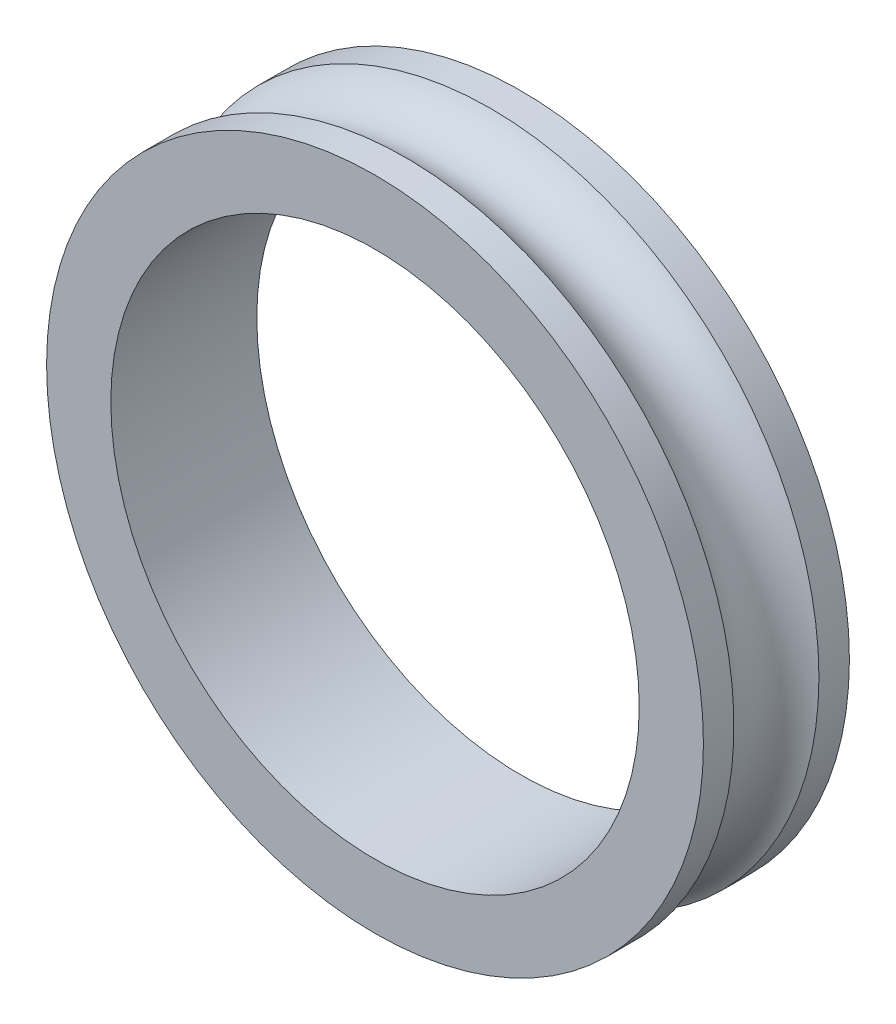
ISO-10303-21;
HEADER;
FILE_DESCRIPTION(('STEP AP214'),'2;1');
FILE_NAME('part.step','',(''),(''),'','','');
FILE_SCHEMA(('AUTOMOTIVE_DESIGN { 1 0 10303 214 1 1 1 1 }'));
ENDSEC;
DATA;
#1=APPLICATION_CONTEXT('core data for automotive mechanical design processes');
#2=APPLICATION_PROTOCOL_DEFINITION('international standard','automotive_design',2000,#1);
#3=PRODUCT_CONTEXT('',#1,'mechanical');
#4=PRODUCT('Part','Part','',(#3));
#5=PRODUCT_RELATED_PRODUCT_CATEGORY('part','',(#4));
#6=PRODUCT_DEFINITION_FORMATION('','',#4);
#7=PRODUCT_DEFINITION_CONTEXT('part definition',#1,'design');
#8=PRODUCT_DEFINITION('design','',#6,#7);
#9=PRODUCT_DEFINITION_SHAPE('','',#8);
#10=(LENGTH_UNIT() NAMED_UNIT(*) SI_UNIT(.MILLI.,.METRE.));
#11=(NAMED_UNIT(*) PLANE_ANGLE_UNIT() SI_UNIT($,.RADIAN.));
#12=(NAMED_UNIT(*) SI_UNIT($,.STERADIAN.) SOLID_ANGLE_UNIT());
#13=UNCERTAINTY_MEASURE_WITH_UNIT(LENGTH_MEASURE(1.E-05),#10,'distance_accuracy_value','');
#14=(GEOMETRIC_REPRESENTATION_CONTEXT(3) GLOBAL_UNCERTAINTY_ASSIGNED_CONTEXT((#13)) GLOBAL_UNIT_ASSIGNED_CONTEXT((#10,
#11,#12)) REPRESENTATION_CONTEXT('',''));
#15=CARTESIAN_POINT('',(0.,0.,0.));
#16=DIRECTION('',(0.,0.,1.));
#17=DIRECTION('',(1.,0.,0.));
#18=AXIS2_PLACEMENT_3D('',#15,#16,#17);
#19=CARTESIAN_POINT('',(0.,0.,73.6396103067893));
#20=DIRECTION('',(0.,0.,-1.));
#21=DIRECTION('',(-1.,0.,0.));
#22=AXIS2_PLACEMENT_3D('',#19,#20,#21);
#23=CYLINDRICAL_SURFACE('',#22,22.5);
#24=CARTESIAN_POINT('',(0.,0.,2.08870733178541));
#25=DIRECTION('',(0.,0.,1.));
#26=DIRECTION('',(1.,0.,0.));
#27=AXIS2_PLACEMENT_3D('',#24,#25,#26);
#28=CIRCLE('',#27,22.5);
#29=CARTESIAN_POINT('',(22.5,0.,2.08870733178541));
#30=VERTEX_POINT('',#29);
#31=EDGE_CURVE('E36',#30,#30,#28,.F.);
#32=ORIENTED_EDGE('',*,*,#31,.T.);
#33=EDGE_LOOP('',(#32));
#34=FACE_BOUND('',#33,.T.);
#35=CARTESIAN_POINT('',(0.,0.,0.));
#36=DIRECTION('',(0.,0.,1.));
#37=DIRECTION('',(1.,0.,0.));
#38=AXIS2_PLACEMENT_3D('',#35,#36,#37);
#39=CIRCLE('',#38,22.5);
#40=CARTESIAN_POINT('',(22.5,0.,0.));
#41=VERTEX_POINT('',#40);
#42=EDGE_CURVE('E40',#41,#41,#39,.T.);
#43=ORIENTED_EDGE('',*,*,#42,.T.);
#44=EDGE_LOOP('',(#43));
#45=FACE_BOUND('',#44,.T.);
#46=ADVANCED_FACE('F32',(#34,#45),#23,.T.);
#47=CARTESIAN_POINT('',(0.,0.,7.9112926682146));
#48=DIRECTION('',(0.,0.,-1.));
#49=DIRECTION('',(-1.,0.,0.));
#50=AXIS2_PLACEMENT_3D('',#47,#48,#49);
#51=CIRCLE('',#50,22.5);
#52=CARTESIAN_POINT('',(-22.5,0.,7.9112926682146));
#53=VERTEX_POINT('',#52);
#54=EDGE_CURVE('E48',#53,#53,#51,.F.);
#55=ORIENTED_EDGE('',*,*,#54,.T.);
#56=EDGE_LOOP('',(#55));
#57=FACE_BOUND('',#56,.T.);
#58=CARTESIAN_POINT('',(0.,0.,9.99999999999999));
#59=DIRECTION('',(0.,0.,1.));
#60=DIRECTION('',(1.,0.,0.));
#61=AXIS2_PLACEMENT_3D('',#58,#59,#60);
#62=CIRCLE('',#61,22.5);
#63=CARTESIAN_POINT('',(22.5,0.,9.99999999999999));
#64=VERTEX_POINT('',#63);
#65=EDGE_CURVE('E10',#64,#64,#62,.T.);
#66=ORIENTED_EDGE('',*,*,#65,.F.);
#67=EDGE_LOOP('',(#66));
#68=FACE_BOUND('',#67,.T.);
#69=ADVANCED_FACE('F68',(#57,#68),#23,.T.);
#70=CARTESIAN_POINT('',(0.,0.,0.));
#71=DIRECTION('',(0.,0.,1.));
#72=DIRECTION('',(1.,0.,0.));
#73=AXIS2_PLACEMENT_3D('',#70,#71,#72);
#74=PLANE('',#73);
#75=CARTESIAN_POINT('',(0.,0.,0.));
#76=DIRECTION('',(0.,0.,1.));
#77=DIRECTION('',(1.,0.,0.));
#78=AXIS2_PLACEMENT_3D('',#75,#76,#77);
#79=CIRCLE('',#78,18.1);
#80=CARTESIAN_POINT('',(18.1,0.,0.));
#81=VERTEX_POINT('',#80);
#82=EDGE_CURVE('E45',#81,#81,#79,.F.);
#83=ORIENTED_EDGE('',*,*,#82,.F.);
#84=EDGE_LOOP('',(#83));
#85=FACE_BOUND('',#84,.T.);
#86=ORIENTED_EDGE('',*,*,#42,.F.);
#87=EDGE_LOOP('',(#86));
#88=FACE_BOUND('',#87,.T.);
#89=ADVANCED_FACE('F65',(#85,#88),#74,.F.);
#90=CARTESIAN_POINT('',(0.,0.,10.));
#91=DIRECTION('',(0.,0.,1.));
#92=DIRECTION('',(1.,0.,0.));
#93=AXIS2_PLACEMENT_3D('',#90,#91,#92);
#94=PLANE('',#93);
#95=CARTESIAN_POINT('',(0.,0.,10.));
#96=DIRECTION('',(0.,0.,1.));
#97=DIRECTION('',(1.,0.,0.));
#98=AXIS2_PLACEMENT_3D('',#95,#96,#97);
#99=CIRCLE('',#98,18.1);
#100=CARTESIAN_POINT('',(18.1,0.,10.));
#101=VERTEX_POINT('',#100);
#102=EDGE_CURVE('E53',#101,#101,#99,.T.);
#103=ORIENTED_EDGE('',*,*,#102,.F.);
#104=EDGE_LOOP('',(#103));
#105=FACE_BOUND('',#104,.T.);
#106=ORIENTED_EDGE('',*,*,#65,.T.);
#107=EDGE_LOOP('',(#106));
#108=FACE_BOUND('',#107,.T.);
#109=ADVANCED_FACE('F34',(#105,#108),#94,.T.);
#110=CARTESIAN_POINT('',(0.,0.,-0.000999999999999265));
#111=DIRECTION('',(0.,0.,1.));
#112=DIRECTION('',(1.,0.,0.));
#113=AXIS2_PLACEMENT_3D('',#110,#111,#112);
#114=CYLINDRICAL_SURFACE('',#113,18.1);
#115=ORIENTED_EDGE('',*,*,#102,.T.);
#116=EDGE_LOOP('',(#115));
#117=FACE_BOUND('',#116,.T.);
#118=ORIENTED_EDGE('',*,*,#82,.T.);
#119=EDGE_LOOP('',(#118));
#120=FACE_BOUND('',#119,.T.);
#121=ADVANCED_FACE('F63',(#117,#120),#114,.F.);
#122=CARTESIAN_POINT('',(0.,0.,5.));
#123=DIRECTION('',(0.,0.,-1.));
#124=DIRECTION('',(-1.,0.,0.));
#125=AXIS2_PLACEMENT_3D('',#122,#123,#124);
#126=TOROIDAL_SURFACE('',#125,24.,3.27500000000001);
#127=ORIENTED_EDGE('',*,*,#54,.F.);
#128=EDGE_LOOP('',(#127));
#129=FACE_BOUND('',#128,.T.);
#130=ORIENTED_EDGE('',*,*,#31,.F.);
#131=EDGE_LOOP('',(#130));
#132=FACE_BOUND('',#131,.T.);
#133=ADVANCED_FACE('F79',(#129,#132),#126,.F.);
#134=CLOSED_SHELL('',(#46,#69,#89,#109,#121,#133));
#135=MANIFOLD_SOLID_BREP('B2',#134);
#136=ADVANCED_BREP_SHAPE_REPRESENTATION('',(#18,#135),#14);
#137=SHAPE_DEFINITION_REPRESENTATION(#9,#136);
ENDSEC;
END-ISO-10303-21;
